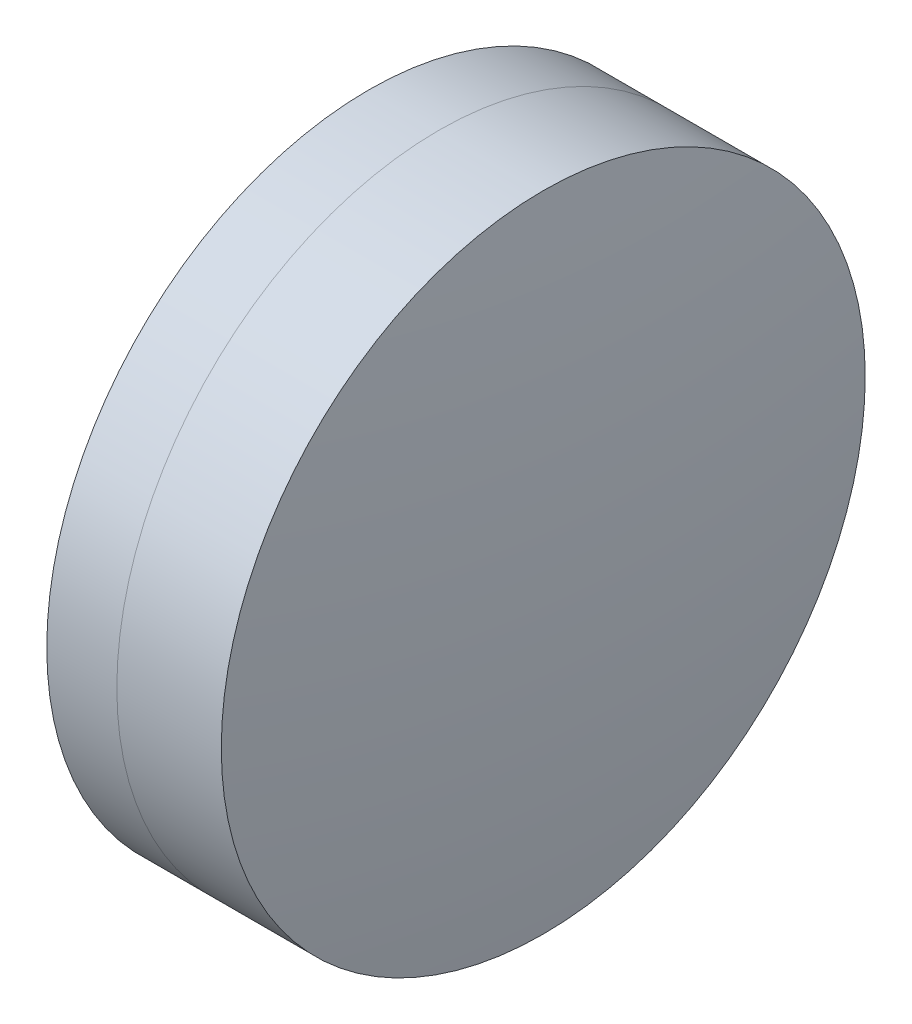
ISO-10303-21;
HEADER;
FILE_DESCRIPTION(('STEP AP214'),'2;1');
FILE_NAME('part.step','',(''),(''),'','','');
FILE_SCHEMA(('AUTOMOTIVE_DESIGN { 1 0 10303 214 1 1 1 1 }'));
ENDSEC;
DATA;
#1=APPLICATION_CONTEXT('core data for automotive mechanical design processes');
#2=APPLICATION_PROTOCOL_DEFINITION('international standard','automotive_design',2000,#1);
#3=PRODUCT_CONTEXT('',#1,'mechanical');
#4=PRODUCT('Part','Part','',(#3));
#5=PRODUCT_RELATED_PRODUCT_CATEGORY('part','',(#4));
#6=PRODUCT_DEFINITION_FORMATION('','',#4);
#7=PRODUCT_DEFINITION_CONTEXT('part definition',#1,'design');
#8=PRODUCT_DEFINITION('design','',#6,#7);
#9=PRODUCT_DEFINITION_SHAPE('','',#8);
#10=(LENGTH_UNIT() NAMED_UNIT(*) SI_UNIT(.MILLI.,.METRE.));
#11=(NAMED_UNIT(*) PLANE_ANGLE_UNIT() SI_UNIT($,.RADIAN.));
#12=(NAMED_UNIT(*) SI_UNIT($,.STERADIAN.) SOLID_ANGLE_UNIT());
#13=UNCERTAINTY_MEASURE_WITH_UNIT(LENGTH_MEASURE(1.E-05),#10,'distance_accuracy_value','');
#14=(GEOMETRIC_REPRESENTATION_CONTEXT(3) GLOBAL_UNCERTAINTY_ASSIGNED_CONTEXT((#13)) GLOBAL_UNIT_ASSIGNED_CONTEXT((#10,
#11,#12)) REPRESENTATION_CONTEXT('',''));
#15=CARTESIAN_POINT('',(0.,0.,0.));
#16=DIRECTION('',(0.,0.,1.));
#17=DIRECTION('',(1.,0.,0.));
#18=AXIS2_PLACEMENT_3D('',#15,#16,#17);
#19=CARTESIAN_POINT('',(211.095845808419,0.,0.));
#20=DIRECTION('',(-1.,0.,0.));
#21=DIRECTION('',(0.,0.,1.));
#22=AXIS2_PLACEMENT_3D('',#19,#20,#21);
#23=SPHERICAL_SURFACE('',#22,33.9);
#24=CARTESIAN_POINT('',(242.527040504135,0.,0.));
#25=DIRECTION('',(-1.,0.,0.));
#26=DIRECTION('',(0.,0.,1.));
#27=AXIS2_PLACEMENT_3D('',#24,#25,#26);
#28=CIRCLE('',#27,12.7);
#29=CARTESIAN_POINT('',(242.527040504135,0.,12.7));
#30=VERTEX_POINT('',#29);
#31=EDGE_CURVE('E11',#30,#30,#28,.T.);
#32=ORIENTED_EDGE('',*,*,#31,.T.);
#33=EDGE_LOOP('',(#32));
#34=FACE_BOUND('',#33,.T.);
#35=ADVANCED_FACE('F45',(#34),#23,.F.);
#36=CARTESIAN_POINT('',(-0.551919992657797,0.,0.));
#37=DIRECTION('',(-1.,0.,0.));
#38=DIRECTION('',(0.,0.,1.));
#39=AXIS2_PLACEMENT_3D('',#36,#37,#38);
#40=CYLINDRICAL_SURFACE('',#39,12.7);
#41=CARTESIAN_POINT('',(246.647628675939,0.,0.));
#42=DIRECTION('',(-1.,0.,0.));
#43=DIRECTION('',(0.,0.,1.));
#44=AXIS2_PLACEMENT_3D('',#41,#42,#43);
#45=CIRCLE('',#44,12.7);
#46=CARTESIAN_POINT('',(246.647628675939,0.,12.7));
#47=VERTEX_POINT('',#46);
#48=EDGE_CURVE('E51',#47,#47,#45,.T.);
#49=ORIENTED_EDGE('',*,*,#48,.T.);
#50=EDGE_LOOP('',(#49));
#51=FACE_BOUND('',#50,.T.);
#52=ORIENTED_EDGE('',*,*,#31,.F.);
#53=EDGE_LOOP('',(#52));
#54=FACE_BOUND('',#53,.T.);
#55=ADVANCED_FACE('F57',(#51,#54),#40,.T.);
#56=CARTESIAN_POINT('',(151.995845808419,0.,0.));
#57=DIRECTION('',(-1.,0.,0.));
#58=DIRECTION('',(0.,0.,1.));
#59=AXIS2_PLACEMENT_3D('',#56,#57,#58);
#60=SPHERICAL_SURFACE('',#59,95.5);
#61=ORIENTED_EDGE('',*,*,#48,.F.);
#62=EDGE_LOOP('',(#61));
#63=FACE_BOUND('',#62,.T.);
#64=ADVANCED_FACE('F60',(#63),#60,.T.);
#65=CLOSED_SHELL('',(#35,#55,#64));
#66=MANIFOLD_SOLID_BREP('B2',#65);
#67=CARTESIAN_POINT('',(284.495845808419,0.,0.));
#68=DIRECTION('',(-1.,0.,0.));
#69=DIRECTION('',(0.,0.,1.));
#70=AXIS2_PLACEMENT_3D('',#67,#68,#69);
#71=SPHERICAL_SURFACE('',#70,46.5);
#72=CARTESIAN_POINT('',(239.763754419798,0.,0.));
#73=DIRECTION('',(-1.,0.,0.));
#74=DIRECTION('',(0.,0.,1.));
#75=AXIS2_PLACEMENT_3D('',#72,#73,#74);
#76=CIRCLE('',#75,12.7);
#77=CARTESIAN_POINT('',(239.763754419798,0.,12.7));
#78=VERTEX_POINT('',#77);
#79=EDGE_CURVE('E44',#78,#78,#76,.T.);
#80=ORIENTED_EDGE('',*,*,#79,.T.);
#81=EDGE_LOOP('',(#80));
#82=FACE_BOUND('',#81,.T.);
#83=ADVANCED_FACE('F86',(#82),#71,.T.);
#84=CARTESIAN_POINT('',(161.833171692834,0.,0.));
#85=DIRECTION('',(-1.,0.,0.));
#86=DIRECTION('',(0.,0.,1.));
#87=AXIS2_PLACEMENT_3D('',#84,#85,#86);
#88=CYLINDRICAL_SURFACE('',#87,12.7);
#89=CARTESIAN_POINT('',(242.527040504135,0.,0.));
#90=DIRECTION('',(-1.,0.,0.));
#91=DIRECTION('',(0.,0.,1.));
#92=AXIS2_PLACEMENT_3D('',#89,#90,#91);
#93=CIRCLE('',#92,12.7);
#94=CARTESIAN_POINT('',(242.527040504135,0.,12.7));
#95=VERTEX_POINT('',#94);
#96=EDGE_CURVE('E92',#95,#95,#93,.T.);
#97=ORIENTED_EDGE('',*,*,#96,.T.);
#98=EDGE_LOOP('',(#97));
#99=FACE_BOUND('',#98,.T.);
#100=ORIENTED_EDGE('',*,*,#79,.F.);
#101=EDGE_LOOP('',(#100));
#102=FACE_BOUND('',#101,.T.);
#103=ADVANCED_FACE('F98',(#99,#102),#88,.T.);
#104=CARTESIAN_POINT('',(211.095845808419,0.,0.));
#105=DIRECTION('',(-1.,0.,0.));
#106=DIRECTION('',(0.,0.,1.));
#107=AXIS2_PLACEMENT_3D('',#104,#105,#106);
#108=SPHERICAL_SURFACE('',#107,33.9);
#109=ORIENTED_EDGE('',*,*,#96,.F.);
#110=EDGE_LOOP('',(#109));
#111=FACE_BOUND('',#110,.T.);
#112=ADVANCED_FACE('F101',(#111),#108,.T.);
#113=CLOSED_SHELL('',(#83,#103,#112));
#114=MANIFOLD_SOLID_BREP('B6',#113);
#115=ADVANCED_BREP_SHAPE_REPRESENTATION('',(#18,#66,#114),#14);
#116=SHAPE_DEFINITION_REPRESENTATION(#9,#115);
ENDSEC;
END-ISO-10303-21;
